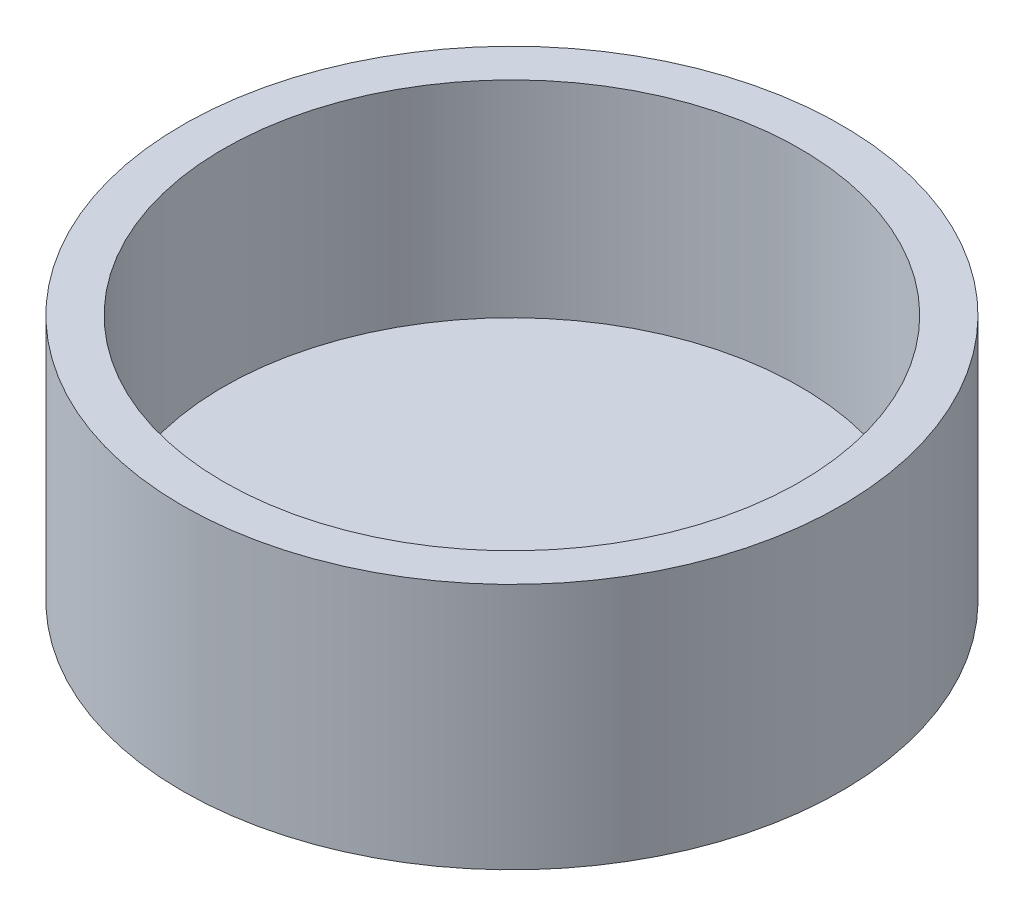
ISO-10303-21;
HEADER;
FILE_DESCRIPTION(('STEP AP214'),'2;1');
FILE_NAME('part.step','',(''),(''),'','','');
FILE_SCHEMA(('AUTOMOTIVE_DESIGN { 1 0 10303 214 1 1 1 1 }'));
ENDSEC;
DATA;
#1=APPLICATION_CONTEXT('core data for automotive mechanical design processes');
#2=APPLICATION_PROTOCOL_DEFINITION('international standard','automotive_design',2000,#1);
#3=PRODUCT_CONTEXT('',#1,'mechanical');
#4=PRODUCT('Part','Part','',(#3));
#5=PRODUCT_RELATED_PRODUCT_CATEGORY('part','',(#4));
#6=PRODUCT_DEFINITION_FORMATION('','',#4);
#7=PRODUCT_DEFINITION_CONTEXT('part definition',#1,'design');
#8=PRODUCT_DEFINITION('design','',#6,#7);
#9=PRODUCT_DEFINITION_SHAPE('','',#8);
#10=(LENGTH_UNIT() NAMED_UNIT(*) SI_UNIT(.MILLI.,.METRE.));
#11=(NAMED_UNIT(*) PLANE_ANGLE_UNIT() SI_UNIT($,.RADIAN.));
#12=(NAMED_UNIT(*) SI_UNIT($,.STERADIAN.) SOLID_ANGLE_UNIT());
#13=UNCERTAINTY_MEASURE_WITH_UNIT(LENGTH_MEASURE(1.E-05),#10,'distance_accuracy_value','');
#14=(GEOMETRIC_REPRESENTATION_CONTEXT(3) GLOBAL_UNCERTAINTY_ASSIGNED_CONTEXT((#13)) GLOBAL_UNIT_ASSIGNED_CONTEXT((#10,
#11,#12)) REPRESENTATION_CONTEXT('',''));
#15=CARTESIAN_POINT('',(0.,0.,0.));
#16=DIRECTION('',(0.,0.,1.));
#17=DIRECTION('',(1.,0.,0.));
#18=AXIS2_PLACEMENT_3D('',#15,#16,#17);
#19=CARTESIAN_POINT('',(0.,76.2,0.));
#20=DIRECTION('',(0.,-1.,0.));
#21=DIRECTION('',(0.,0.,-1.));
#22=AXIS2_PLACEMENT_3D('',#19,#20,#21);
#23=CYLINDRICAL_SURFACE('',#22,101.6);
#24=CARTESIAN_POINT('',(0.,76.2,0.));
#25=DIRECTION('',(0.,1.,0.));
#26=DIRECTION('',(0.,0.,1.));
#27=AXIS2_PLACEMENT_3D('',#24,#25,#26);
#28=CIRCLE('',#27,101.6);
#29=CARTESIAN_POINT('',(0.,76.2,101.6));
#30=VERTEX_POINT('',#29);
#31=EDGE_CURVE('E44',#30,#30,#28,.T.);
#32=ORIENTED_EDGE('',*,*,#31,.F.);
#33=EDGE_LOOP('',(#32));
#34=FACE_BOUND('',#33,.T.);
#35=CARTESIAN_POINT('',(0.,0.,0.));
#36=DIRECTION('',(0.,1.,0.));
#37=DIRECTION('',(0.,0.,1.));
#38=AXIS2_PLACEMENT_3D('',#35,#36,#37);
#39=CIRCLE('',#38,101.6);
#40=CARTESIAN_POINT('',(0.,0.,101.6));
#41=VERTEX_POINT('',#40);
#42=EDGE_CURVE('E49',#41,#41,#39,.T.);
#43=ORIENTED_EDGE('',*,*,#42,.T.);
#44=EDGE_LOOP('',(#43));
#45=FACE_BOUND('',#44,.T.);
#46=ADVANCED_FACE('F37',(#34,#45),#23,.T.);
#47=CARTESIAN_POINT('',(0.,76.2,0.));
#48=DIRECTION('',(0.,1.,0.));
#49=DIRECTION('',(0.,0.,1.));
#50=AXIS2_PLACEMENT_3D('',#47,#48,#49);
#51=PLANE('',#50);
#52=CARTESIAN_POINT('',(0.,76.2,0.));
#53=DIRECTION('',(0.,1.,0.));
#54=DIRECTION('',(0.,0.,1.));
#55=AXIS2_PLACEMENT_3D('',#52,#53,#54);
#56=CIRCLE('',#55,88.9);
#57=CARTESIAN_POINT('',(0.,76.2,88.9));
#58=VERTEX_POINT('',#57);
#59=EDGE_CURVE('E57',#58,#58,#56,.T.);
#60=ORIENTED_EDGE('',*,*,#59,.F.);
#61=EDGE_LOOP('',(#60));
#62=FACE_BOUND('',#61,.T.);
#63=ORIENTED_EDGE('',*,*,#31,.T.);
#64=EDGE_LOOP('',(#63));
#65=FACE_BOUND('',#64,.T.);
#66=ADVANCED_FACE('F97',(#62,#65),#51,.T.);
#67=CARTESIAN_POINT('',(0.,0.,0.));
#68=DIRECTION('',(0.,1.,0.));
#69=DIRECTION('',(0.,0.,1.));
#70=AXIS2_PLACEMENT_3D('',#67,#68,#69);
#71=PLANE('',#70);
#72=CARTESIAN_POINT('',(0.,0.,0.));
#73=DIRECTION('',(0.,1.,0.));
#74=DIRECTION('',(0.,0.,1.));
#75=AXIS2_PLACEMENT_3D('',#72,#73,#74);
#76=CIRCLE('',#75,12.7);
#77=CARTESIAN_POINT('',(0.,0.,12.7));
#78=VERTEX_POINT('',#77);
#79=EDGE_CURVE('E10',#78,#78,#76,.F.);
#80=ORIENTED_EDGE('',*,*,#79,.F.);
#81=EDGE_LOOP('',(#80));
#82=FACE_BOUND('',#81,.T.);
#83=ORIENTED_EDGE('',*,*,#42,.F.);
#84=EDGE_LOOP('',(#83));
#85=FACE_BOUND('',#84,.T.);
#86=ADVANCED_FACE('F102',(#82,#85),#71,.F.);
#87=CARTESIAN_POINT('',(0.,12.7,0.));
#88=DIRECTION('',(0.,1.,0.));
#89=DIRECTION('',(0.,0.,1.));
#90=AXIS2_PLACEMENT_3D('',#87,#88,#89);
#91=CYLINDRICAL_SURFACE('',#90,88.9);
#92=CARTESIAN_POINT('',(0.,12.7,0.));
#93=DIRECTION('',(0.,1.,0.));
#94=DIRECTION('',(0.,0.,1.));
#95=AXIS2_PLACEMENT_3D('',#92,#93,#94);
#96=CIRCLE('',#95,88.9);
#97=CARTESIAN_POINT('',(0.,12.7,88.9));
#98=VERTEX_POINT('',#97);
#99=EDGE_CURVE('E55',#98,#98,#96,.T.);
#100=ORIENTED_EDGE('',*,*,#99,.F.);
#101=EDGE_LOOP('',(#100));
#102=FACE_BOUND('',#101,.T.);
#103=ORIENTED_EDGE('',*,*,#59,.T.);
#104=EDGE_LOOP('',(#103));
#105=FACE_BOUND('',#104,.T.);
#106=ADVANCED_FACE('F92',(#102,#105),#91,.F.);
#107=CARTESIAN_POINT('',(0.,12.7,0.));
#108=DIRECTION('',(0.,1.,0.));
#109=DIRECTION('',(0.,0.,1.));
#110=AXIS2_PLACEMENT_3D('',#107,#108,#109);
#111=PLANE('',#110);
#112=ORIENTED_EDGE('',*,*,#99,.T.);
#113=EDGE_LOOP('',(#112));
#114=FACE_BOUND('',#113,.T.);
#115=ADVANCED_FACE('F83',(#114),#111,.T.);
#116=CARTESIAN_POINT('',(0.,-25.4,0.));
#117=DIRECTION('',(0.,-1.,0.));
#118=DIRECTION('',(0.,0.,-1.));
#119=AXIS2_PLACEMENT_3D('',#116,#117,#118);
#120=PLANE('',#119);
#121=CARTESIAN_POINT('',(0.,-25.4,0.));
#122=DIRECTION('',(0.,-1.,0.));
#123=DIRECTION('',(0.,0.,-1.));
#124=AXIS2_PLACEMENT_3D('',#121,#122,#123);
#125=CIRCLE('',#124,12.7);
#126=CARTESIAN_POINT('',(0.,-25.4,-12.7));
#127=VERTEX_POINT('',#126);
#128=EDGE_CURVE('E61',#127,#127,#125,.T.);
#129=ORIENTED_EDGE('',*,*,#128,.T.);
#130=EDGE_LOOP('',(#129));
#131=FACE_BOUND('',#130,.T.);
#132=CARTESIAN_POINT('',(0.,-25.4,0.));
#133=DIRECTION('',(0.,-1.,0.));
#134=DIRECTION('',(0.,0.,-1.));
#135=AXIS2_PLACEMENT_3D('',#132,#133,#134);
#136=CIRCLE('',#135,9.525);
#137=CARTESIAN_POINT('',(0.,-25.4,-9.525));
#138=VERTEX_POINT('',#137);
#139=EDGE_CURVE('E68',#138,#138,#136,.T.);
#140=ORIENTED_EDGE('',*,*,#139,.F.);
#141=EDGE_LOOP('',(#140));
#142=FACE_BOUND('',#141,.T.);
#143=ADVANCED_FACE('F80',(#131,#142),#120,.T.);
#144=CARTESIAN_POINT('',(0.,-25.4,0.));
#145=DIRECTION('',(0.,1.,0.));
#146=DIRECTION('',(0.,0.,1.));
#147=AXIS2_PLACEMENT_3D('',#144,#145,#146);
#148=CYLINDRICAL_SURFACE('',#147,12.7);
#149=ORIENTED_EDGE('',*,*,#128,.F.);
#150=EDGE_LOOP('',(#149));
#151=FACE_BOUND('',#150,.T.);
#152=ORIENTED_EDGE('',*,*,#79,.T.);
#153=EDGE_LOOP('',(#152));
#154=FACE_BOUND('',#153,.T.);
#155=ADVANCED_FACE('F82',(#151,#154),#148,.T.);
#156=CARTESIAN_POINT('',(0.,-25.4,0.));
#157=DIRECTION('',(0.,1.,0.));
#158=DIRECTION('',(0.,0.,1.));
#159=AXIS2_PLACEMENT_3D('',#156,#157,#158);
#160=CYLINDRICAL_SURFACE('',#159,9.525);
#161=ORIENTED_EDGE('',*,*,#139,.T.);
#162=EDGE_LOOP('',(#161));
#163=FACE_BOUND('',#162,.T.);
#164=CARTESIAN_POINT('',(0.,0.,0.));
#165=DIRECTION('',(0.,-1.,0.));
#166=DIRECTION('',(0.,0.,-1.));
#167=AXIS2_PLACEMENT_3D('',#164,#165,#166);
#168=CIRCLE('',#167,9.525);
#169=CARTESIAN_POINT('',(0.,0.,-9.525));
#170=VERTEX_POINT('',#169);
#171=EDGE_CURVE('E69',#170,#170,#168,.T.);
#172=ORIENTED_EDGE('',*,*,#171,.F.);
#173=EDGE_LOOP('',(#172));
#174=FACE_BOUND('',#173,.T.);
#175=ADVANCED_FACE('F77',(#163,#174),#160,.F.);
#176=ORIENTED_EDGE('',*,*,#171,.T.);
#177=EDGE_LOOP('',(#176));
#178=FACE_BOUND('',#177,.T.);
#179=ADVANCED_FACE('F110',(#178),#71,.F.);
#180=CLOSED_SHELL('',(#46,#66,#86,#106,#115,#143,#155,#175,#179));
#181=MANIFOLD_SOLID_BREP('B2',#180);
#182=ADVANCED_BREP_SHAPE_REPRESENTATION('',(#18,#181),#14);
#183=SHAPE_DEFINITION_REPRESENTATION(#9,#182);
ENDSEC;
END-ISO-10303-21;
